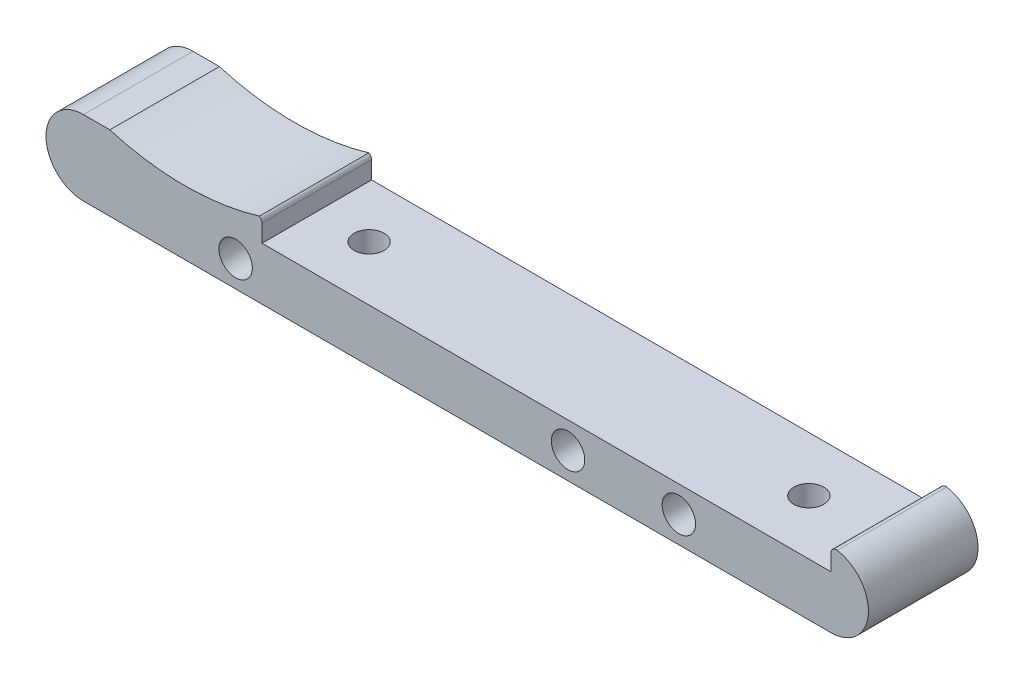
ISO-10303-21;
HEADER;
FILE_DESCRIPTION(('STEP AP214'),'2;1');
FILE_NAME('part.step','',(''),(''),'','','');
FILE_SCHEMA(('AUTOMOTIVE_DESIGN { 1 0 10303 214 1 1 1 1 }'));
ENDSEC;
DATA;
#1=APPLICATION_CONTEXT('core data for automotive mechanical design processes');
#2=APPLICATION_PROTOCOL_DEFINITION('international standard','automotive_design',2000,#1);
#3=PRODUCT_CONTEXT('',#1,'mechanical');
#4=PRODUCT('Part','Part','',(#3));
#5=PRODUCT_RELATED_PRODUCT_CATEGORY('part','',(#4));
#6=PRODUCT_DEFINITION_FORMATION('','',#4);
#7=PRODUCT_DEFINITION_CONTEXT('part definition',#1,'design');
#8=PRODUCT_DEFINITION('design','',#6,#7);
#9=PRODUCT_DEFINITION_SHAPE('','',#8);
#10=(LENGTH_UNIT() NAMED_UNIT(*) SI_UNIT(.MILLI.,.METRE.));
#11=(NAMED_UNIT(*) PLANE_ANGLE_UNIT() SI_UNIT($,.RADIAN.));
#12=(NAMED_UNIT(*) SI_UNIT($,.STERADIAN.) SOLID_ANGLE_UNIT());
#13=UNCERTAINTY_MEASURE_WITH_UNIT(LENGTH_MEASURE(1.E-05),#10,'distance_accuracy_value','');
#14=(GEOMETRIC_REPRESENTATION_CONTEXT(3) GLOBAL_UNCERTAINTY_ASSIGNED_CONTEXT((#13)) GLOBAL_UNIT_ASSIGNED_CONTEXT((#10,
#11,#12)) REPRESENTATION_CONTEXT('',''));
#15=CARTESIAN_POINT('',(0.,0.,0.));
#16=DIRECTION('',(0.,0.,1.));
#17=DIRECTION('',(1.,0.,0.));
#18=AXIS2_PLACEMENT_3D('',#15,#16,#17);
#19=CARTESIAN_POINT('',(0.,10.8204,15.8242));
#20=DIRECTION('',(0.,-1.,0.));
#21=DIRECTION('',(1.,0.,0.));
#22=AXIS2_PLACEMENT_3D('',#19,#20,#21);
#23=PLANE('',#22);
#24=DIRECTION('',(-1.,0.,0.));
#25=VECTOR('',#24,1.);
#26=CARTESIAN_POINT('',(0.,10.8204,15.8242));
#27=LINE('',#26,#25);
#28=CARTESIAN_POINT('',(3.81,10.8204,15.8242));
#29=VERTEX_POINT('',#28);
#30=CARTESIAN_POINT('',(0.,10.8204,15.8242));
#31=VERTEX_POINT('',#30);
#32=EDGE_CURVE('E126',#29,#31,#27,.T.);
#33=ORIENTED_EDGE('',*,*,#32,.F.);
#34=DIRECTION('',(0.,0.,-1.));
#35=VECTOR('',#34,1.);
#36=CARTESIAN_POINT('',(3.81,10.8204,37.471868980814));
#37=LINE('',#36,#35);
#38=CARTESIAN_POINT('',(3.81,10.8204,0.));
#39=VERTEX_POINT('',#38);
#40=EDGE_CURVE('E114',#29,#39,#37,.T.);
#41=ORIENTED_EDGE('',*,*,#40,.T.);
#42=DIRECTION('',(-1.,0.,0.));
#43=VECTOR('',#42,1.);
#44=CARTESIAN_POINT('',(0.,10.8204,0.));
#45=LINE('',#44,#43);
#46=CARTESIAN_POINT('',(0.,10.8204,0.));
#47=VERTEX_POINT('',#46);
#48=EDGE_CURVE('E124',#39,#47,#45,.T.);
#49=ORIENTED_EDGE('',*,*,#48,.T.);
#50=DIRECTION('',(0.,0.,-1.));
#51=VECTOR('',#50,1.);
#52=CARTESIAN_POINT('',(0.,10.8204,15.8242));
#53=LINE('',#52,#51);
#54=EDGE_CURVE('E158',#31,#47,#53,.T.);
#55=ORIENTED_EDGE('',*,*,#54,.F.);
#56=EDGE_LOOP('',(#33,#41,#49,#55));
#57=FACE_BOUND('',#56,.T.);
#58=ADVANCED_FACE('F33',(#57),#23,.F.);
#59=CARTESIAN_POINT('',(107.95,5.4102,15.8242));
#60=DIRECTION('',(0.,0.,-1.));
#61=DIRECTION('',(-1.,0.,0.));
#62=AXIS2_PLACEMENT_3D('',#59,#60,#61);
#63=PLANE('',#62);
#64=DIRECTION('',(0.,1.,0.));
#65=VECTOR('',#64,1.);
#66=CARTESIAN_POINT('',(25.781,10.8204,15.8242));
#67=LINE('',#66,#65);
#68=CARTESIAN_POINT('',(25.781,7.62,15.8242));
#69=VERTEX_POINT('',#68);
#70=CARTESIAN_POINT('',(25.781,10.1604886423163,15.8242));
#71=VERTEX_POINT('',#70);
#72=EDGE_CURVE('E196',#69,#71,#67,.T.);
#73=ORIENTED_EDGE('',*,*,#72,.T.);
#74=CARTESIAN_POINT('',(25.019,10.1604886423163,15.8242));
#75=DIRECTION('',(0.,0.,-1.));
#76=DIRECTION('',(-1.,0.,0.));
#77=AXIS2_PLACEMENT_3D('',#74,#75,#76);
#78=CIRCLE('',#77,0.762);
#79=CARTESIAN_POINT('',(25.4,10.8204,15.8242));
#80=VERTEX_POINT('',#79);
#81=EDGE_CURVE('E170',#71,#80,#78,.F.);
#82=ORIENTED_EDGE('',*,*,#81,.T.);
#83=CARTESIAN_POINT('',(14.605,46.9297297258133,15.8242));
#84=DIRECTION('',(0.,0.,-1.));
#85=DIRECTION('',(-1.,0.,0.));
#86=AXIS2_PLACEMENT_3D('',#83,#84,#85);
#87=CIRCLE('',#86,37.6884029675908);
#88=EDGE_CURVE('E223',#29,#80,#87,.F.);
#89=ORIENTED_EDGE('',*,*,#88,.F.);
#90=ORIENTED_EDGE('',*,*,#32,.T.);
#91=CARTESIAN_POINT('',(0.,5.4102,15.8242));
#92=DIRECTION('',(0.,0.,1.));
#93=DIRECTION('',(1.,0.,0.));
#94=AXIS2_PLACEMENT_3D('',#91,#92,#93);
#95=CIRCLE('',#94,5.4102);
#96=CARTESIAN_POINT('',(0.,0.,15.8242));
#97=VERTEX_POINT('',#96);
#98=EDGE_CURVE('E193',#31,#97,#95,.T.);
#99=ORIENTED_EDGE('',*,*,#98,.T.);
#100=DIRECTION('',(1.,0.,0.));
#101=VECTOR('',#100,1.);
#102=CARTESIAN_POINT('',(0.,0.,15.8242));
#103=LINE('',#102,#101);
#104=CARTESIAN_POINT('',(107.95,0.,15.8242));
#105=VERTEX_POINT('',#104);
#106=EDGE_CURVE('E191',#97,#105,#103,.T.);
#107=ORIENTED_EDGE('',*,*,#106,.T.);
#108=CARTESIAN_POINT('',(107.95,5.4102,15.8242));
#109=DIRECTION('',(0.,0.,1.));
#110=DIRECTION('',(-1.,0.,0.));
#111=AXIS2_PLACEMENT_3D('',#108,#109,#110);
#112=CIRCLE('',#111,5.4102);
#113=CARTESIAN_POINT('',(108.836918032787,10.7472066931865,15.8242));
#114=VERTEX_POINT('',#113);
#115=EDGE_CURVE('E189',#105,#114,#112,.T.);
#116=ORIENTED_EDGE('',*,*,#115,.T.);
#117=CARTESIAN_POINT('',(108.712,9.99551560963911,15.8242));
#118=DIRECTION('',(0.,0.,-1.));
#119=DIRECTION('',(-1.,0.,0.));
#120=AXIS2_PLACEMENT_3D('',#117,#118,#119);
#121=CIRCLE('',#120,0.762);
#122=CARTESIAN_POINT('',(107.95,9.99551560963911,15.8242));
#123=VERTEX_POINT('',#122);
#124=EDGE_CURVE('E48',#114,#123,#121,.F.);
#125=ORIENTED_EDGE('',*,*,#124,.T.);
#126=DIRECTION('',(0.,-1.,0.));
#127=VECTOR('',#126,1.);
#128=CARTESIAN_POINT('',(107.95,10.8204,15.8242));
#129=LINE('',#128,#127);
#130=CARTESIAN_POINT('',(107.95,7.62,15.8242));
#131=VERTEX_POINT('',#130);
#132=EDGE_CURVE('E152',#123,#131,#129,.T.);
#133=ORIENTED_EDGE('',*,*,#132,.T.);
#134=DIRECTION('',(-1.,0.,0.));
#135=VECTOR('',#134,1.);
#136=CARTESIAN_POINT('',(25.781,7.62,15.8242));
#137=LINE('',#136,#135);
#138=EDGE_CURVE('E147',#131,#69,#137,.T.);
#139=ORIENTED_EDGE('',*,*,#138,.T.);
#140=EDGE_LOOP('',(#73,#82,#89,#90,#99,#107,#116,#125,#133,#139));
#141=FACE_BOUND('',#140,.T.);
#142=CARTESIAN_POINT('',(21.971,3.81,15.8242));
#143=DIRECTION('',(0.,0.,1.));
#144=DIRECTION('',(1.,0.,0.));
#145=AXIS2_PLACEMENT_3D('',#142,#143,#144);
#146=CIRCLE('',#145,2.41299999999999);
#147=CARTESIAN_POINT('',(24.384,3.81,15.8242));
#148=VERTEX_POINT('',#147);
#149=EDGE_CURVE('E183',#148,#148,#146,.T.);
#150=ORIENTED_EDGE('',*,*,#149,.F.);
#151=EDGE_LOOP('',(#150));
#152=FACE_BOUND('',#151,.T.);
#153=CARTESIAN_POINT('',(69.977,3.81,15.8242));
#154=DIRECTION('',(0.,0.,1.));
#155=DIRECTION('',(1.,0.,0.));
#156=AXIS2_PLACEMENT_3D('',#153,#154,#155);
#157=CIRCLE('',#156,2.413);
#158=CARTESIAN_POINT('',(72.39,3.81,15.8242));
#159=VERTEX_POINT('',#158);
#160=EDGE_CURVE('E202',#159,#159,#157,.T.);
#161=ORIENTED_EDGE('',*,*,#160,.F.);
#162=EDGE_LOOP('',(#161));
#163=FACE_BOUND('',#162,.T.);
#164=CARTESIAN_POINT('',(85.979,3.81,15.8242));
#165=DIRECTION('',(0.,0.,1.));
#166=DIRECTION('',(1.,0.,0.));
#167=AXIS2_PLACEMENT_3D('',#164,#165,#166);
#168=CIRCLE('',#167,2.41300000000001);
#169=CARTESIAN_POINT('',(88.392,3.81,15.8242));
#170=VERTEX_POINT('',#169);
#171=EDGE_CURVE('E207',#170,#170,#168,.T.);
#172=ORIENTED_EDGE('',*,*,#171,.F.);
#173=EDGE_LOOP('',(#172));
#174=FACE_BOUND('',#173,.T.);
#175=ADVANCED_FACE('F237',(#141,#152,#163,#174),#63,.F.);
#176=CARTESIAN_POINT('',(107.95,5.4102,0.));
#177=DIRECTION('',(0.,0.,-1.));
#178=DIRECTION('',(-1.,0.,0.));
#179=AXIS2_PLACEMENT_3D('',#176,#177,#178);
#180=PLANE('',#179);
#181=CARTESIAN_POINT('',(14.605,46.9297297258133,0.));
#182=DIRECTION('',(0.,0.,-1.));
#183=DIRECTION('',(1.,0.,0.));
#184=AXIS2_PLACEMENT_3D('',#181,#182,#183);
#185=CIRCLE('',#184,37.6884029675908);
#186=CARTESIAN_POINT('',(25.4,10.8204,0.));
#187=VERTEX_POINT('',#186);
#188=EDGE_CURVE('E110',#187,#39,#185,.T.);
#189=ORIENTED_EDGE('',*,*,#188,.F.);
#190=CARTESIAN_POINT('',(25.019,10.1604886423163,0.));
#191=DIRECTION('',(0.,0.,-1.));
#192=DIRECTION('',(-1.,0.,0.));
#193=AXIS2_PLACEMENT_3D('',#190,#191,#192);
#194=CIRCLE('',#193,0.762);
#195=CARTESIAN_POINT('',(25.781,10.1604886423163,0.));
#196=VERTEX_POINT('',#195);
#197=EDGE_CURVE('E165',#187,#196,#194,.T.);
#198=ORIENTED_EDGE('',*,*,#197,.T.);
#199=DIRECTION('',(0.,1.,0.));
#200=VECTOR('',#199,1.);
#201=CARTESIAN_POINT('',(25.781,10.8204,0.));
#202=LINE('',#201,#200);
#203=CARTESIAN_POINT('',(25.781,7.62,0.));
#204=VERTEX_POINT('',#203);
#205=EDGE_CURVE('E133',#204,#196,#202,.T.);
#206=ORIENTED_EDGE('',*,*,#205,.F.);
#207=DIRECTION('',(-1.,0.,0.));
#208=VECTOR('',#207,1.);
#209=CARTESIAN_POINT('',(25.781,7.62,0.));
#210=LINE('',#209,#208);
#211=CARTESIAN_POINT('',(107.95,7.62,0.));
#212=VERTEX_POINT('',#211);
#213=EDGE_CURVE('E138',#212,#204,#210,.T.);
#214=ORIENTED_EDGE('',*,*,#213,.F.);
#215=DIRECTION('',(0.,-1.,0.));
#216=VECTOR('',#215,1.);
#217=CARTESIAN_POINT('',(107.95,10.8204,0.));
#218=LINE('',#217,#216);
#219=CARTESIAN_POINT('',(107.95,9.99551560963911,0.));
#220=VERTEX_POINT('',#219);
#221=EDGE_CURVE('E145',#220,#212,#218,.T.);
#222=ORIENTED_EDGE('',*,*,#221,.F.);
#223=CARTESIAN_POINT('',(108.712,9.99551560963911,0.));
#224=DIRECTION('',(0.,0.,-1.));
#225=DIRECTION('',(-1.,0.,0.));
#226=AXIS2_PLACEMENT_3D('',#223,#224,#225);
#227=CIRCLE('',#226,0.762);
#228=CARTESIAN_POINT('',(108.836918032787,10.7472066931865,0.));
#229=VERTEX_POINT('',#228);
#230=EDGE_CURVE('E163',#220,#229,#227,.T.);
#231=ORIENTED_EDGE('',*,*,#230,.T.);
#232=CARTESIAN_POINT('',(107.95,5.4102,0.));
#233=DIRECTION('',(0.,0.,1.));
#234=DIRECTION('',(-1.,0.,0.));
#235=AXIS2_PLACEMENT_3D('',#232,#233,#234);
#236=CIRCLE('',#235,5.4102);
#237=CARTESIAN_POINT('',(107.95,0.,0.));
#238=VERTEX_POINT('',#237);
#239=EDGE_CURVE('E143',#238,#229,#236,.T.);
#240=ORIENTED_EDGE('',*,*,#239,.F.);
#241=DIRECTION('',(1.,0.,0.));
#242=VECTOR('',#241,1.);
#243=CARTESIAN_POINT('',(0.,0.,0.));
#244=LINE('',#243,#242);
#245=CARTESIAN_POINT('',(0.,0.,0.));
#246=VERTEX_POINT('',#245);
#247=EDGE_CURVE('E135',#246,#238,#244,.T.);
#248=ORIENTED_EDGE('',*,*,#247,.F.);
#249=CARTESIAN_POINT('',(0.,5.4102,0.));
#250=DIRECTION('',(0.,0.,1.));
#251=DIRECTION('',(1.,0.,0.));
#252=AXIS2_PLACEMENT_3D('',#249,#250,#251);
#253=CIRCLE('',#252,5.4102);
#254=EDGE_CURVE('E132',#47,#246,#253,.T.);
#255=ORIENTED_EDGE('',*,*,#254,.F.);
#256=ORIENTED_EDGE('',*,*,#48,.F.);
#257=EDGE_LOOP('',(#189,#198,#206,#214,#222,#231,#240,#248,#255,#256));
#258=FACE_BOUND('',#257,.T.);
#259=CARTESIAN_POINT('',(69.977,3.81,0.));
#260=DIRECTION('',(0.,0.,1.));
#261=DIRECTION('',(1.,0.,0.));
#262=AXIS2_PLACEMENT_3D('',#259,#260,#261);
#263=CIRCLE('',#262,2.413);
#264=CARTESIAN_POINT('',(72.39,3.81,0.));
#265=VERTEX_POINT('',#264);
#266=EDGE_CURVE('E204',#265,#265,#263,.T.);
#267=ORIENTED_EDGE('',*,*,#266,.T.);
#268=EDGE_LOOP('',(#267));
#269=FACE_BOUND('',#268,.T.);
#270=CARTESIAN_POINT('',(21.971,3.81,0.));
#271=DIRECTION('',(0.,0.,1.));
#272=DIRECTION('',(1.,0.,0.));
#273=AXIS2_PLACEMENT_3D('',#270,#271,#272);
#274=CIRCLE('',#273,2.41299999999999);
#275=CARTESIAN_POINT('',(24.384,3.81,0.));
#276=VERTEX_POINT('',#275);
#277=EDGE_CURVE('E185',#276,#276,#274,.T.);
#278=ORIENTED_EDGE('',*,*,#277,.T.);
#279=EDGE_LOOP('',(#278));
#280=FACE_BOUND('',#279,.T.);
#281=CARTESIAN_POINT('',(85.979,3.81,0.));
#282=DIRECTION('',(0.,0.,1.));
#283=DIRECTION('',(1.,0.,0.));
#284=AXIS2_PLACEMENT_3D('',#281,#282,#283);
#285=CIRCLE('',#284,2.41300000000001);
#286=CARTESIAN_POINT('',(88.392,3.81,0.));
#287=VERTEX_POINT('',#286);
#288=EDGE_CURVE('E210',#287,#287,#285,.T.);
#289=ORIENTED_EDGE('',*,*,#288,.T.);
#290=EDGE_LOOP('',(#289));
#291=FACE_BOUND('',#290,.T.);
#292=ADVANCED_FACE('F129',(#258,#269,#280,#291),#180,.T.);
#293=CARTESIAN_POINT('',(25.781,7.62,15.8242));
#294=DIRECTION('',(0.,-1.,0.));
#295=DIRECTION('',(0.,0.,-1.));
#296=AXIS2_PLACEMENT_3D('',#293,#294,#295);
#297=PLANE('',#296);
#298=CARTESIAN_POINT('',(96.8375,7.62,7.91209999999995));
#299=DIRECTION('',(0.,1.,0.));
#300=DIRECTION('',(0.,0.,1.));
#301=AXIS2_PLACEMENT_3D('',#298,#299,#300);
#302=CIRCLE('',#301,2.15899999999999);
#303=CARTESIAN_POINT('',(96.8375,7.62,10.0710999999999));
#304=VERTEX_POINT('',#303);
#305=EDGE_CURVE('E219',#304,#304,#302,.T.);
#306=ORIENTED_EDGE('',*,*,#305,.F.);
#307=EDGE_LOOP('',(#306));
#308=FACE_BOUND('',#307,.T.);
#309=CARTESIAN_POINT('',(33.3375,7.62,7.91209999999999));
#310=DIRECTION('',(0.,1.,0.));
#311=DIRECTION('',(0.,0.,1.));
#312=AXIS2_PLACEMENT_3D('',#309,#310,#311);
#313=CIRCLE('',#312,2.15899999999999);
#314=CARTESIAN_POINT('',(33.3375,7.62,10.0711));
#315=VERTEX_POINT('',#314);
#316=EDGE_CURVE('E220',#315,#315,#313,.T.);
#317=ORIENTED_EDGE('',*,*,#316,.F.);
#318=EDGE_LOOP('',(#317));
#319=FACE_BOUND('',#318,.T.);
#320=ORIENTED_EDGE('',*,*,#213,.T.);
#321=DIRECTION('',(0.,0.,-1.));
#322=VECTOR('',#321,1.);
#323=CARTESIAN_POINT('',(25.781,7.62,15.8242));
#324=LINE('',#323,#322);
#325=EDGE_CURVE('E160',#69,#204,#324,.T.);
#326=ORIENTED_EDGE('',*,*,#325,.F.);
#327=ORIENTED_EDGE('',*,*,#138,.F.);
#328=DIRECTION('',(0.,0.,-1.));
#329=VECTOR('',#328,1.);
#330=CARTESIAN_POINT('',(107.95,7.62,15.8242));
#331=LINE('',#330,#329);
#332=EDGE_CURVE('E148',#131,#212,#331,.T.);
#333=ORIENTED_EDGE('',*,*,#332,.T.);
#334=EDGE_LOOP('',(#320,#326,#327,#333));
#335=FACE_BOUND('',#334,.T.);
#336=ADVANCED_FACE('F236',(#308,#319,#335),#297,.F.);
#337=CARTESIAN_POINT('',(25.781,10.8204,15.8242));
#338=DIRECTION('',(-1.,0.,0.));
#339=DIRECTION('',(0.,0.,1.));
#340=AXIS2_PLACEMENT_3D('',#337,#338,#339);
#341=PLANE('',#340);
#342=ORIENTED_EDGE('',*,*,#205,.T.);
#343=DIRECTION('',(0.,0.,-1.));
#344=VECTOR('',#343,1.);
#345=CARTESIAN_POINT('',(25.781,10.1604886423163,15.8242));
#346=LINE('',#345,#344);
#347=EDGE_CURVE('E167',#196,#71,#346,.F.);
#348=ORIENTED_EDGE('',*,*,#347,.T.);
#349=ORIENTED_EDGE('',*,*,#72,.F.);
#350=ORIENTED_EDGE('',*,*,#325,.T.);
#351=EDGE_LOOP('',(#342,#348,#349,#350));
#352=FACE_BOUND('',#351,.T.);
#353=ADVANCED_FACE('F234',(#352),#341,.F.);
#354=CARTESIAN_POINT('',(0.,5.4102,15.8242));
#355=DIRECTION('',(0.,0.,-1.));
#356=DIRECTION('',(-1.,0.,0.));
#357=AXIS2_PLACEMENT_3D('',#354,#355,#356);
#358=CYLINDRICAL_SURFACE('',#357,5.4102);
#359=ORIENTED_EDGE('',*,*,#254,.T.);
#360=DIRECTION('',(0.,0.,-1.));
#361=VECTOR('',#360,1.);
#362=CARTESIAN_POINT('',(0.,0.,15.8242));
#363=LINE('',#362,#361);
#364=EDGE_CURVE('E155',#97,#246,#363,.T.);
#365=ORIENTED_EDGE('',*,*,#364,.F.);
#366=ORIENTED_EDGE('',*,*,#98,.F.);
#367=ORIENTED_EDGE('',*,*,#54,.T.);
#368=EDGE_LOOP('',(#359,#365,#366,#367));
#369=FACE_BOUND('',#368,.T.);
#370=ADVANCED_FACE('F269',(#369),#358,.T.);
#371=CARTESIAN_POINT('',(0.,0.,15.8242));
#372=DIRECTION('',(0.,1.,0.));
#373=DIRECTION('',(0.,0.,1.));
#374=AXIS2_PLACEMENT_3D('',#371,#372,#373);
#375=PLANE('',#374);
#376=CARTESIAN_POINT('',(96.8375,0.,7.91209999999995));
#377=DIRECTION('',(0.,1.,0.));
#378=DIRECTION('',(0.,0.,1.));
#379=AXIS2_PLACEMENT_3D('',#376,#377,#378);
#380=CIRCLE('',#379,2.15899999999999);
#381=CARTESIAN_POINT('',(96.8375,0.,10.0710999999999));
#382=VERTEX_POINT('',#381);
#383=EDGE_CURVE('E213',#382,#382,#380,.F.);
#384=ORIENTED_EDGE('',*,*,#383,.F.);
#385=EDGE_LOOP('',(#384));
#386=FACE_BOUND('',#385,.T.);
#387=CARTESIAN_POINT('',(33.3375,0.,7.91209999999999));
#388=DIRECTION('',(0.,1.,0.));
#389=DIRECTION('',(0.,0.,1.));
#390=AXIS2_PLACEMENT_3D('',#387,#388,#389);
#391=CIRCLE('',#390,2.15899999999999);
#392=CARTESIAN_POINT('',(33.3375,0.,10.0711));
#393=VERTEX_POINT('',#392);
#394=EDGE_CURVE('E216',#393,#393,#391,.F.);
#395=ORIENTED_EDGE('',*,*,#394,.F.);
#396=EDGE_LOOP('',(#395));
#397=FACE_BOUND('',#396,.T.);
#398=ORIENTED_EDGE('',*,*,#247,.T.);
#399=DIRECTION('',(0.,0.,-1.));
#400=VECTOR('',#399,1.);
#401=CARTESIAN_POINT('',(107.95,0.,15.8242));
#402=LINE('',#401,#400);
#403=EDGE_CURVE('E151',#105,#238,#402,.T.);
#404=ORIENTED_EDGE('',*,*,#403,.F.);
#405=ORIENTED_EDGE('',*,*,#106,.F.);
#406=ORIENTED_EDGE('',*,*,#364,.T.);
#407=EDGE_LOOP('',(#398,#404,#405,#406));
#408=FACE_BOUND('',#407,.T.);
#409=ADVANCED_FACE('F304',(#386,#397,#408),#375,.F.);
#410=CARTESIAN_POINT('',(107.95,5.4102,15.8242));
#411=DIRECTION('',(0.,0.,-1.));
#412=DIRECTION('',(-1.,0.,0.));
#413=AXIS2_PLACEMENT_3D('',#410,#411,#412);
#414=CYLINDRICAL_SURFACE('',#413,5.4102);
#415=ORIENTED_EDGE('',*,*,#239,.T.);
#416=DIRECTION('',(0.,0.,-1.));
#417=VECTOR('',#416,1.);
#418=CARTESIAN_POINT('',(108.836918032787,10.7472066931865,15.8242));
#419=LINE('',#418,#417);
#420=EDGE_CURVE('E11',#229,#114,#419,.F.);
#421=ORIENTED_EDGE('',*,*,#420,.T.);
#422=ORIENTED_EDGE('',*,*,#115,.F.);
#423=ORIENTED_EDGE('',*,*,#403,.T.);
#424=EDGE_LOOP('',(#415,#421,#422,#423));
#425=FACE_BOUND('',#424,.T.);
#426=ADVANCED_FACE('F297',(#425),#414,.T.);
#427=CARTESIAN_POINT('',(107.95,10.8204,15.8242));
#428=DIRECTION('',(1.,0.,0.));
#429=DIRECTION('',(0.,0.,-1.));
#430=AXIS2_PLACEMENT_3D('',#427,#428,#429);
#431=PLANE('',#430);
#432=ORIENTED_EDGE('',*,*,#132,.F.);
#433=DIRECTION('',(0.,0.,-1.));
#434=VECTOR('',#433,1.);
#435=CARTESIAN_POINT('',(107.95,9.99551560963911,15.8242));
#436=LINE('',#435,#434);
#437=EDGE_CURVE('E41',#123,#220,#436,.T.);
#438=ORIENTED_EDGE('',*,*,#437,.T.);
#439=ORIENTED_EDGE('',*,*,#221,.T.);
#440=ORIENTED_EDGE('',*,*,#332,.F.);
#441=EDGE_LOOP('',(#432,#438,#439,#440));
#442=FACE_BOUND('',#441,.T.);
#443=ADVANCED_FACE('F175',(#442),#431,.F.);
#444=CARTESIAN_POINT('',(21.971,3.81,15.8242));
#445=DIRECTION('',(0.,0.,-1.));
#446=DIRECTION('',(-1.,0.,0.));
#447=AXIS2_PLACEMENT_3D('',#444,#445,#446);
#448=CYLINDRICAL_SURFACE('',#447,2.41299999999999);
#449=ORIENTED_EDGE('',*,*,#149,.T.);
#450=EDGE_LOOP('',(#449));
#451=FACE_BOUND('',#450,.T.);
#452=ORIENTED_EDGE('',*,*,#277,.F.);
#453=EDGE_LOOP('',(#452));
#454=FACE_BOUND('',#453,.T.);
#455=ADVANCED_FACE('F290',(#451,#454),#448,.F.);
#456=CARTESIAN_POINT('',(69.977,3.81,15.8242));
#457=DIRECTION('',(0.,0.,-1.));
#458=DIRECTION('',(-1.,0.,0.));
#459=AXIS2_PLACEMENT_3D('',#456,#457,#458);
#460=CYLINDRICAL_SURFACE('',#459,2.413);
#461=ORIENTED_EDGE('',*,*,#160,.T.);
#462=EDGE_LOOP('',(#461));
#463=FACE_BOUND('',#462,.T.);
#464=ORIENTED_EDGE('',*,*,#266,.F.);
#465=EDGE_LOOP('',(#464));
#466=FACE_BOUND('',#465,.T.);
#467=ADVANCED_FACE('F251',(#463,#466),#460,.F.);
#468=CARTESIAN_POINT('',(85.979,3.81,15.8242));
#469=DIRECTION('',(0.,0.,-1.));
#470=DIRECTION('',(-1.,0.,0.));
#471=AXIS2_PLACEMENT_3D('',#468,#469,#470);
#472=CYLINDRICAL_SURFACE('',#471,2.41300000000001);
#473=ORIENTED_EDGE('',*,*,#171,.T.);
#474=EDGE_LOOP('',(#473));
#475=FACE_BOUND('',#474,.T.);
#476=ORIENTED_EDGE('',*,*,#288,.F.);
#477=EDGE_LOOP('',(#476));
#478=FACE_BOUND('',#477,.T.);
#479=ADVANCED_FACE('F247',(#475,#478),#472,.F.);
#480=CARTESIAN_POINT('',(33.3375,-6.10657416232701,7.91209999999999));
#481=DIRECTION('',(0.,1.,0.));
#482=DIRECTION('',(0.,0.,1.));
#483=AXIS2_PLACEMENT_3D('',#480,#481,#482);
#484=CYLINDRICAL_SURFACE('',#483,2.15899999999999);
#485=CARTESIAN_POINT('',(33.3375,0.,10.0711));
#486=CARTESIAN_POINT('',(33.3375,0.0793750000000001,10.0711));
#487=CARTESIAN_POINT('',(33.3375,0.15875,10.0711));
#488=CARTESIAN_POINT('',(33.3375,0.3175,10.0711));
#489=CARTESIAN_POINT('',(33.3375,0.396875,10.0711));
#490=CARTESIAN_POINT('',(33.3375,0.555625,10.0711));
#491=CARTESIAN_POINT('',(33.3375,0.635,10.0711));
#492=CARTESIAN_POINT('',(33.3375,0.79375,10.0711));
#493=CARTESIAN_POINT('',(33.3375,0.873125,10.0711));
#494=CARTESIAN_POINT('',(33.3375,1.031875,10.0711));
#495=CARTESIAN_POINT('',(33.3375,1.11125,10.0711));
#496=CARTESIAN_POINT('',(33.3375,1.27,10.0711));
#497=CARTESIAN_POINT('',(33.3375,1.349375,10.0711));
#498=CARTESIAN_POINT('',(33.3375,1.508125,10.0711));
#499=CARTESIAN_POINT('',(33.3375,1.5875,10.0711));
#500=CARTESIAN_POINT('',(33.3375,1.74625,10.0711));
#501=CARTESIAN_POINT('',(33.3375,1.825625,10.0711));
#502=CARTESIAN_POINT('',(33.3375,1.984375,10.0711));
#503=CARTESIAN_POINT('',(33.3375,2.06375,10.0711));
#504=CARTESIAN_POINT('',(33.3375,2.2225,10.0711));
#505=CARTESIAN_POINT('',(33.3375,2.301875,10.0711));
#506=CARTESIAN_POINT('',(33.3375,2.460625,10.0711));
#507=CARTESIAN_POINT('',(33.3375,2.54,10.0711));
#508=CARTESIAN_POINT('',(33.3375,2.69875,10.0711));
#509=CARTESIAN_POINT('',(33.3375,2.778125,10.0711));
#510=CARTESIAN_POINT('',(33.3375,2.936875,10.0711));
#511=CARTESIAN_POINT('',(33.3375,3.01625,10.0711));
#512=CARTESIAN_POINT('',(33.3375,3.175,10.0711));
#513=CARTESIAN_POINT('',(33.3375,3.254375,10.0711));
#514=CARTESIAN_POINT('',(33.3375,3.413125,10.0711));
#515=CARTESIAN_POINT('',(33.3375,3.4925,10.0711));
#516=CARTESIAN_POINT('',(33.3375,3.65125,10.0711));
#517=CARTESIAN_POINT('',(33.3375,3.730625,10.0711));
#518=CARTESIAN_POINT('',(33.3375,3.889375,10.0711));
#519=CARTESIAN_POINT('',(33.3375,3.96875,10.0711));
#520=CARTESIAN_POINT('',(33.3375,4.1275,10.0711));
#521=CARTESIAN_POINT('',(33.3375,4.206875,10.0711));
#522=CARTESIAN_POINT('',(33.3375,4.365625,10.0711));
#523=CARTESIAN_POINT('',(33.3375,4.445,10.0711));
#524=CARTESIAN_POINT('',(33.3375,4.60375,10.0711));
#525=CARTESIAN_POINT('',(33.3375,4.683125,10.0711));
#526=CARTESIAN_POINT('',(33.3375,4.841875,10.0711));
#527=CARTESIAN_POINT('',(33.3375,4.92125,10.0711));
#528=CARTESIAN_POINT('',(33.3375,5.08,10.0711));
#529=CARTESIAN_POINT('',(33.3375,5.159375,10.0711));
#530=CARTESIAN_POINT('',(33.3375,5.318125,10.0711));
#531=CARTESIAN_POINT('',(33.3375,5.3975,10.0711));
#532=CARTESIAN_POINT('',(33.3375,5.55625,10.0711));
#533=CARTESIAN_POINT('',(33.3375,5.635625,10.0711));
#534=CARTESIAN_POINT('',(33.3375,5.794375,10.0711));
#535=CARTESIAN_POINT('',(33.3375,5.87375,10.0711));
#536=CARTESIAN_POINT('',(33.3375,6.0325,10.0711));
#537=CARTESIAN_POINT('',(33.3375,6.111875,10.0711));
#538=CARTESIAN_POINT('',(33.3375,6.270625,10.0711));
#539=CARTESIAN_POINT('',(33.3375,6.35,10.0711));
#540=CARTESIAN_POINT('',(33.3375,6.50875,10.0711));
#541=CARTESIAN_POINT('',(33.3375,6.588125,10.0711));
#542=CARTESIAN_POINT('',(33.3375,6.746875,10.0711));
#543=CARTESIAN_POINT('',(33.3375,6.82625,10.0711));
#544=CARTESIAN_POINT('',(33.3375,6.985,10.0711));
#545=CARTESIAN_POINT('',(33.3375,7.064375,10.0711));
#546=CARTESIAN_POINT('',(33.3375,7.223125,10.0711));
#547=CARTESIAN_POINT('',(33.3375,7.3025,10.0711));
#548=CARTESIAN_POINT('',(33.3375,7.46125,10.0711));
#549=CARTESIAN_POINT('',(33.3375,7.540625,10.0711));
#550=CARTESIAN_POINT('',(33.3375,7.62,10.0711));
#551=B_SPLINE_CURVE_WITH_KNOTS('',3,(#485,#486,#487,#488,#489,#490,#491,#492,#493,#494,#495,
#496,#497,#498,#499,#500,#501,#502,#503,#504,#505,#506,#507,#508,#509,#510,#511,#512,#513,#514,
#515,#516,#517,#518,#519,#520,#521,#522,#523,#524,#525,#526,#527,#528,#529,#530,#531,#532,#533,
#534,#535,#536,#537,#538,#539,#540,#541,#542,#543,#544,#545,#546,#547,#548,#549,#550),
.UNSPECIFIED.,.F.,.F.,(4,2,2,2,2,2,2,2,2,2,2,2,2,2,2,2,2,2,2,2,2,2,2,2,2,2,2,2,2,2,2,2,4),(0.,
0.238125,0.47625,0.714375000000001,0.9525,1.190625,1.42875,1.666875,1.905,2.143125,2.38125,
2.619375,2.8575,3.095625,3.33375,3.571875,3.81,4.048125,4.28625,4.524375,4.7625,5.000625,
5.23875,5.476875,5.715,5.953125,6.19125,6.429375,6.6675,6.905625,7.14375,7.381875,7.62),.UNSPECIFIED.);
#552=EDGE_CURVE('BSEAM250',#393,#315,#551,.T.);
#553=ORIENTED_EDGE('',*,*,#394,.T.);
#554=ORIENTED_EDGE('',*,*,#316,.T.);
#555=ORIENTED_EDGE('',*,*,#552,.T.);
#556=ORIENTED_EDGE('',*,*,#552,.F.);
#557=EDGE_LOOP('',(#553,#555,#554,#556));
#558=FACE_BOUND('',#557,.T.);
#559=ADVANCED_FACE('F250',(#558),#484,.F.);
#560=CARTESIAN_POINT('',(96.8375,-6.10657416232701,7.91209999999995));
#561=DIRECTION('',(0.,1.,0.));
#562=DIRECTION('',(0.,0.,1.));
#563=AXIS2_PLACEMENT_3D('',#560,#561,#562);
#564=CYLINDRICAL_SURFACE('',#563,2.15899999999999);
#565=CARTESIAN_POINT('',(96.8375,0.,10.0710999999999));
#566=CARTESIAN_POINT('',(96.8375,0.0793750000000001,10.0710999999999));
#567=CARTESIAN_POINT('',(96.8375,0.15875,10.0710999999999));
#568=CARTESIAN_POINT('',(96.8375,0.3175,10.0710999999999));
#569=CARTESIAN_POINT('',(96.8375,0.396875,10.0710999999999));
#570=CARTESIAN_POINT('',(96.8375,0.555625,10.0710999999999));
#571=CARTESIAN_POINT('',(96.8375,0.635,10.0710999999999));
#572=CARTESIAN_POINT('',(96.8375,0.79375,10.0710999999999));
#573=CARTESIAN_POINT('',(96.8375,0.873125,10.0710999999999));
#574=CARTESIAN_POINT('',(96.8375,1.031875,10.0710999999999));
#575=CARTESIAN_POINT('',(96.8375,1.11125,10.0710999999999));
#576=CARTESIAN_POINT('',(96.8375,1.27,10.0710999999999));
#577=CARTESIAN_POINT('',(96.8375,1.349375,10.0710999999999));
#578=CARTESIAN_POINT('',(96.8375,1.508125,10.0710999999999));
#579=CARTESIAN_POINT('',(96.8375,1.5875,10.0710999999999));
#580=CARTESIAN_POINT('',(96.8375,1.74625,10.0710999999999));
#581=CARTESIAN_POINT('',(96.8375,1.825625,10.0710999999999));
#582=CARTESIAN_POINT('',(96.8375,1.984375,10.0710999999999));
#583=CARTESIAN_POINT('',(96.8375,2.06375,10.0710999999999));
#584=CARTESIAN_POINT('',(96.8375,2.2225,10.0710999999999));
#585=CARTESIAN_POINT('',(96.8375,2.301875,10.0710999999999));
#586=CARTESIAN_POINT('',(96.8375,2.460625,10.0710999999999));
#587=CARTESIAN_POINT('',(96.8375,2.54,10.0710999999999));
#588=CARTESIAN_POINT('',(96.8375,2.69875,10.0710999999999));
#589=CARTESIAN_POINT('',(96.8375,2.778125,10.0710999999999));
#590=CARTESIAN_POINT('',(96.8375,2.936875,10.0710999999999));
#591=CARTESIAN_POINT('',(96.8375,3.01625,10.0710999999999));
#592=CARTESIAN_POINT('',(96.8375,3.175,10.0710999999999));
#593=CARTESIAN_POINT('',(96.8375,3.254375,10.0710999999999));
#594=CARTESIAN_POINT('',(96.8375,3.413125,10.0710999999999));
#595=CARTESIAN_POINT('',(96.8375,3.4925,10.0710999999999));
#596=CARTESIAN_POINT('',(96.8375,3.65125,10.0710999999999));
#597=CARTESIAN_POINT('',(96.8375,3.730625,10.0710999999999));
#598=CARTESIAN_POINT('',(96.8375,3.889375,10.0710999999999));
#599=CARTESIAN_POINT('',(96.8375,3.96875,10.0710999999999));
#600=CARTESIAN_POINT('',(96.8375,4.1275,10.0710999999999));
#601=CARTESIAN_POINT('',(96.8375,4.206875,10.0710999999999));
#602=CARTESIAN_POINT('',(96.8375,4.365625,10.0710999999999));
#603=CARTESIAN_POINT('',(96.8375,4.445,10.0710999999999));
#604=CARTESIAN_POINT('',(96.8375,4.60375,10.0710999999999));
#605=CARTESIAN_POINT('',(96.8375,4.683125,10.0710999999999));
#606=CARTESIAN_POINT('',(96.8375,4.841875,10.0710999999999));
#607=CARTESIAN_POINT('',(96.8375,4.92125,10.0710999999999));
#608=CARTESIAN_POINT('',(96.8375,5.08,10.0710999999999));
#609=CARTESIAN_POINT('',(96.8375,5.159375,10.0710999999999));
#610=CARTESIAN_POINT('',(96.8375,5.318125,10.0710999999999));
#611=CARTESIAN_POINT('',(96.8375,5.3975,10.0710999999999));
#612=CARTESIAN_POINT('',(96.8375,5.55625,10.0710999999999));
#613=CARTESIAN_POINT('',(96.8375,5.635625,10.0710999999999));
#614=CARTESIAN_POINT('',(96.8375,5.794375,10.0710999999999));
#615=CARTESIAN_POINT('',(96.8375,5.87375,10.0710999999999));
#616=CARTESIAN_POINT('',(96.8375,6.0325,10.0710999999999));
#617=CARTESIAN_POINT('',(96.8375,6.111875,10.0710999999999));
#618=CARTESIAN_POINT('',(96.8375,6.270625,10.0710999999999));
#619=CARTESIAN_POINT('',(96.8375,6.35,10.0710999999999));
#620=CARTESIAN_POINT('',(96.8375,6.50875,10.0710999999999));
#621=CARTESIAN_POINT('',(96.8375,6.588125,10.0710999999999));
#622=CARTESIAN_POINT('',(96.8375,6.746875,10.0710999999999));
#623=CARTESIAN_POINT('',(96.8375,6.82625,10.0710999999999));
#624=CARTESIAN_POINT('',(96.8375,6.985,10.0710999999999));
#625=CARTESIAN_POINT('',(96.8375,7.064375,10.0710999999999));
#626=CARTESIAN_POINT('',(96.8375,7.223125,10.0710999999999));
#627=CARTESIAN_POINT('',(96.8375,7.3025,10.0710999999999));
#628=CARTESIAN_POINT('',(96.8375,7.46125,10.0710999999999));
#629=CARTESIAN_POINT('',(96.8375,7.540625,10.0710999999999));
#630=CARTESIAN_POINT('',(96.8375,7.62,10.0710999999999));
#631=B_SPLINE_CURVE_WITH_KNOTS('',3,(#565,#566,#567,#568,#569,#570,#571,#572,#573,#574,#575,
#576,#577,#578,#579,#580,#581,#582,#583,#584,#585,#586,#587,#588,#589,#590,#591,#592,#593,#594,
#595,#596,#597,#598,#599,#600,#601,#602,#603,#604,#605,#606,#607,#608,#609,#610,#611,#612,#613,
#614,#615,#616,#617,#618,#619,#620,#621,#622,#623,#624,#625,#626,#627,#628,#629,#630),
.UNSPECIFIED.,.F.,.F.,(4,2,2,2,2,2,2,2,2,2,2,2,2,2,2,2,2,2,2,2,2,2,2,2,2,2,2,2,2,2,2,2,4),(0.,
0.238125,0.47625,0.714375000000001,0.9525,1.190625,1.42875,1.666875,1.905,2.143125,2.38125,
2.619375,2.8575,3.095625,3.33375,3.571875,3.81,4.048125,4.28625,4.524375,4.7625,5.000625,
5.23875,5.476875,5.715,5.953125,6.19125,6.429375,6.6675,6.905625,7.14375,7.381875,7.62),.UNSPECIFIED.);
#632=EDGE_CURVE('BSEAM277',#382,#304,#631,.T.);
#633=ORIENTED_EDGE('',*,*,#383,.T.);
#634=ORIENTED_EDGE('',*,*,#305,.T.);
#635=ORIENTED_EDGE('',*,*,#632,.T.);
#636=ORIENTED_EDGE('',*,*,#632,.F.);
#637=EDGE_LOOP('',(#633,#635,#634,#636));
#638=FACE_BOUND('',#637,.T.);
#639=ADVANCED_FACE('F277',(#638),#564,.F.);
#640=CARTESIAN_POINT('',(14.605,46.9297297258133,37.471868980814));
#641=DIRECTION('',(0.,0.,-1.));
#642=DIRECTION('',(-1.,0.,0.));
#643=AXIS2_PLACEMENT_3D('',#640,#641,#642);
#644=CYLINDRICAL_SURFACE('',#643,37.6884029675908);
#645=ORIENTED_EDGE('',*,*,#88,.T.);
#646=DIRECTION('',(0.,0.,-1.));
#647=VECTOR('',#646,1.);
#648=CARTESIAN_POINT('',(25.4,10.8204,37.471868980814));
#649=LINE('',#648,#647);
#650=EDGE_CURVE('E117',#80,#187,#649,.T.);
#651=ORIENTED_EDGE('',*,*,#650,.T.);
#652=ORIENTED_EDGE('',*,*,#188,.T.);
#653=ORIENTED_EDGE('',*,*,#40,.F.);
#654=EDGE_LOOP('',(#645,#651,#652,#653));
#655=FACE_BOUND('',#654,.T.);
#656=ADVANCED_FACE('F113',(#655),#644,.F.);
#657=CARTESIAN_POINT('',(25.019,10.1604886423163,37.471868980814));
#658=DIRECTION('',(0.,0.,-1.));
#659=DIRECTION('',(-1.,0.,0.));
#660=AXIS2_PLACEMENT_3D('',#657,#658,#659);
#661=CYLINDRICAL_SURFACE('',#660,0.762);
#662=ORIENTED_EDGE('',*,*,#81,.F.);
#663=ORIENTED_EDGE('',*,*,#347,.F.);
#664=ORIENTED_EDGE('',*,*,#197,.F.);
#665=ORIENTED_EDGE('',*,*,#650,.F.);
#666=EDGE_LOOP('',(#662,#663,#664,#665));
#667=FACE_BOUND('',#666,.T.);
#668=ADVANCED_FACE('F231',(#667),#661,.T.);
#669=CARTESIAN_POINT('',(108.712,9.99551560963911,15.8242));
#670=DIRECTION('',(0.,0.,-1.));
#671=DIRECTION('',(-1.,0.,0.));
#672=AXIS2_PLACEMENT_3D('',#669,#670,#671);
#673=CYLINDRICAL_SURFACE('',#672,0.762);
#674=ORIENTED_EDGE('',*,*,#124,.F.);
#675=ORIENTED_EDGE('',*,*,#420,.F.);
#676=ORIENTED_EDGE('',*,*,#230,.F.);
#677=ORIENTED_EDGE('',*,*,#437,.F.);
#678=EDGE_LOOP('',(#674,#675,#676,#677));
#679=FACE_BOUND('',#678,.T.);
#680=ADVANCED_FACE('F35',(#679),#673,.T.);
#681=CLOSED_SHELL('',(#58,#175,#292,#336,#353,#370,#409,#426,#443,#455,#467,#479,#559,#639,#656,
#668,#680));
#682=MANIFOLD_SOLID_BREP('B2',#681);
#683=ADVANCED_BREP_SHAPE_REPRESENTATION('',(#18,#682),#14);
#684=SHAPE_DEFINITION_REPRESENTATION(#9,#683);
ENDSEC;
END-ISO-10303-21;
